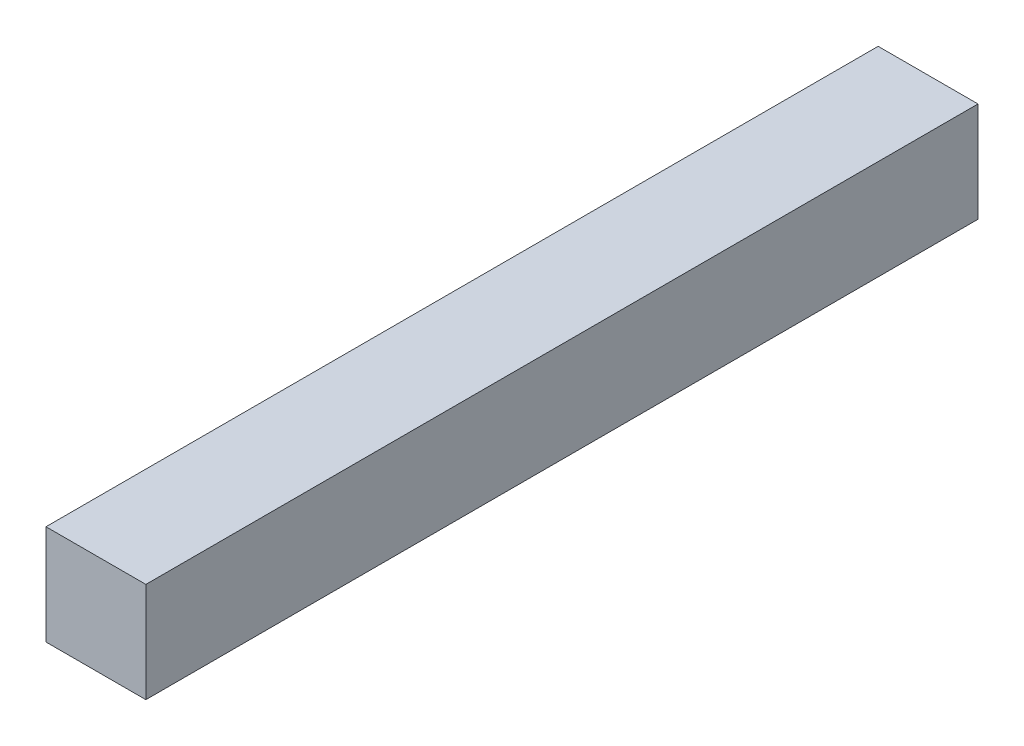
ISO-10303-21;
HEADER;
FILE_DESCRIPTION(('STEP AP214'),'2;1');
FILE_NAME('part.step','',(''),(''),'','','');
FILE_SCHEMA(('AUTOMOTIVE_DESIGN { 1 0 10303 214 1 1 1 1 }'));
ENDSEC;
DATA;
#1=APPLICATION_CONTEXT('core data for automotive mechanical design processes');
#2=APPLICATION_PROTOCOL_DEFINITION('international standard','automotive_design',2000,#1);
#3=PRODUCT_CONTEXT('',#1,'mechanical');
#4=PRODUCT('Part','Part','',(#3));
#5=PRODUCT_RELATED_PRODUCT_CATEGORY('part','',(#4));
#6=PRODUCT_DEFINITION_FORMATION('','',#4);
#7=PRODUCT_DEFINITION_CONTEXT('part definition',#1,'design');
#8=PRODUCT_DEFINITION('design','',#6,#7);
#9=PRODUCT_DEFINITION_SHAPE('','',#8);
#10=(LENGTH_UNIT() NAMED_UNIT(*) SI_UNIT(.MILLI.,.METRE.));
#11=(NAMED_UNIT(*) PLANE_ANGLE_UNIT() SI_UNIT($,.RADIAN.));
#12=(NAMED_UNIT(*) SI_UNIT($,.STERADIAN.) SOLID_ANGLE_UNIT());
#13=UNCERTAINTY_MEASURE_WITH_UNIT(LENGTH_MEASURE(1.E-05),#10,'distance_accuracy_value','');
#14=(GEOMETRIC_REPRESENTATION_CONTEXT(3) GLOBAL_UNCERTAINTY_ASSIGNED_CONTEXT((#13)) GLOBAL_UNIT_ASSIGNED_CONTEXT((#10,
#11,#12)) REPRESENTATION_CONTEXT('',''));
#15=CARTESIAN_POINT('',(0.,0.,0.));
#16=DIRECTION('',(0.,0.,1.));
#17=DIRECTION('',(1.,0.,0.));
#18=AXIS2_PLACEMENT_3D('',#15,#16,#17);
#19=CARTESIAN_POINT('',(0.,0.,25.));
#20=DIRECTION('',(1.,0.,0.));
#21=DIRECTION('',(0.,1.,0.));
#22=AXIS2_PLACEMENT_3D('',#19,#20,#21);
#23=PLANE('',#22);
#24=DIRECTION('',(0.,-1.,0.));
#25=VECTOR('',#24,1.);
#26=CARTESIAN_POINT('',(0.,0.,0.));
#27=LINE('',#26,#25);
#28=CARTESIAN_POINT('',(0.,0.,0.));
#29=VERTEX_POINT('',#28);
#30=CARTESIAN_POINT('',(0.,-3.,0.));
#31=VERTEX_POINT('',#30);
#32=EDGE_CURVE('E109',#29,#31,#27,.T.);
#33=ORIENTED_EDGE('',*,*,#32,.T.);
#34=DIRECTION('',(0.,0.,-1.));
#35=VECTOR('',#34,1.);
#36=CARTESIAN_POINT('',(0.,-3.,25.));
#37=LINE('',#36,#35);
#38=CARTESIAN_POINT('',(0.,-3.,25.));
#39=VERTEX_POINT('',#38);
#40=EDGE_CURVE('E11',#39,#31,#37,.T.);
#41=ORIENTED_EDGE('',*,*,#40,.F.);
#42=DIRECTION('',(0.,-1.,0.));
#43=VECTOR('',#42,1.);
#44=CARTESIAN_POINT('',(0.,0.,25.));
#45=LINE('',#44,#43);
#46=CARTESIAN_POINT('',(0.,0.,25.));
#47=VERTEX_POINT('',#46);
#48=EDGE_CURVE('E93',#47,#39,#45,.T.);
#49=ORIENTED_EDGE('',*,*,#48,.F.);
#50=DIRECTION('',(0.,0.,-1.));
#51=VECTOR('',#50,1.);
#52=CARTESIAN_POINT('',(0.,0.,25.));
#53=LINE('',#52,#51);
#54=EDGE_CURVE('E105',#47,#29,#53,.T.);
#55=ORIENTED_EDGE('',*,*,#54,.T.);
#56=EDGE_LOOP('',(#33,#41,#49,#55));
#57=FACE_BOUND('',#56,.T.);
#58=ADVANCED_FACE('F41',(#57),#23,.F.);
#59=CARTESIAN_POINT('',(0.,-3.,25.));
#60=DIRECTION('',(0.,1.,0.));
#61=DIRECTION('',(0.,0.,1.));
#62=AXIS2_PLACEMENT_3D('',#59,#60,#61);
#63=PLANE('',#62);
#64=DIRECTION('',(1.,0.,0.));
#65=VECTOR('',#64,1.);
#66=CARTESIAN_POINT('',(0.,-3.,0.));
#67=LINE('',#66,#65);
#68=CARTESIAN_POINT('',(3.,-3.,0.));
#69=VERTEX_POINT('',#68);
#70=EDGE_CURVE('E98',#31,#69,#67,.T.);
#71=ORIENTED_EDGE('',*,*,#70,.T.);
#72=DIRECTION('',(0.,0.,-1.));
#73=VECTOR('',#72,1.);
#74=CARTESIAN_POINT('',(3.,-3.,25.));
#75=LINE('',#74,#73);
#76=CARTESIAN_POINT('',(3.,-3.,25.));
#77=VERTEX_POINT('',#76);
#78=EDGE_CURVE('E50',#77,#69,#75,.T.);
#79=ORIENTED_EDGE('',*,*,#78,.F.);
#80=DIRECTION('',(1.,0.,0.));
#81=VECTOR('',#80,1.);
#82=CARTESIAN_POINT('',(0.,-3.,25.));
#83=LINE('',#82,#81);
#84=EDGE_CURVE('E88',#39,#77,#83,.T.);
#85=ORIENTED_EDGE('',*,*,#84,.F.);
#86=ORIENTED_EDGE('',*,*,#40,.T.);
#87=EDGE_LOOP('',(#71,#79,#85,#86));
#88=FACE_BOUND('',#87,.T.);
#89=ADVANCED_FACE('F97',(#88),#63,.F.);
#90=CARTESIAN_POINT('',(3.,0.,25.));
#91=DIRECTION('',(-1.,0.,0.));
#92=DIRECTION('',(0.,-1.,0.));
#93=AXIS2_PLACEMENT_3D('',#90,#91,#92);
#94=PLANE('',#93);
#95=DIRECTION('',(0.,1.,0.));
#96=VECTOR('',#95,1.);
#97=CARTESIAN_POINT('',(3.,0.,0.));
#98=LINE('',#97,#96);
#99=CARTESIAN_POINT('',(3.,0.,0.));
#100=VERTEX_POINT('',#99);
#101=EDGE_CURVE('E75',#69,#100,#98,.T.);
#102=ORIENTED_EDGE('',*,*,#101,.T.);
#103=DIRECTION('',(0.,0.,-1.));
#104=VECTOR('',#103,1.);
#105=CARTESIAN_POINT('',(3.,0.,25.));
#106=LINE('',#105,#104);
#107=CARTESIAN_POINT('',(3.,0.,25.));
#108=VERTEX_POINT('',#107);
#109=EDGE_CURVE('E100',#108,#100,#106,.T.);
#110=ORIENTED_EDGE('',*,*,#109,.F.);
#111=DIRECTION('',(0.,1.,0.));
#112=VECTOR('',#111,1.);
#113=CARTESIAN_POINT('',(3.,0.,25.));
#114=LINE('',#113,#112);
#115=EDGE_CURVE('E91',#77,#108,#114,.T.);
#116=ORIENTED_EDGE('',*,*,#115,.F.);
#117=ORIENTED_EDGE('',*,*,#78,.T.);
#118=EDGE_LOOP('',(#102,#110,#116,#117));
#119=FACE_BOUND('',#118,.T.);
#120=ADVANCED_FACE('F101',(#119),#94,.F.);
#121=CARTESIAN_POINT('',(0.,0.,25.));
#122=DIRECTION('',(0.,-1.,0.));
#123=DIRECTION('',(0.,0.,-1.));
#124=AXIS2_PLACEMENT_3D('',#121,#122,#123);
#125=PLANE('',#124);
#126=DIRECTION('',(-1.,0.,0.));
#127=VECTOR('',#126,1.);
#128=CARTESIAN_POINT('',(0.,0.,0.));
#129=LINE('',#128,#127);
#130=EDGE_CURVE('E81',#100,#29,#129,.T.);
#131=ORIENTED_EDGE('',*,*,#130,.T.);
#132=ORIENTED_EDGE('',*,*,#54,.F.);
#133=DIRECTION('',(-1.,0.,0.));
#134=VECTOR('',#133,1.);
#135=CARTESIAN_POINT('',(0.,0.,25.));
#136=LINE('',#135,#134);
#137=EDGE_CURVE('E58',#108,#47,#136,.T.);
#138=ORIENTED_EDGE('',*,*,#137,.F.);
#139=ORIENTED_EDGE('',*,*,#109,.T.);
#140=EDGE_LOOP('',(#131,#132,#138,#139));
#141=FACE_BOUND('',#140,.T.);
#142=ADVANCED_FACE('F122',(#141),#125,.F.);
#143=CARTESIAN_POINT('',(0.,0.,25.));
#144=DIRECTION('',(0.,0.,1.));
#145=DIRECTION('',(1.,0.,0.));
#146=AXIS2_PLACEMENT_3D('',#143,#144,#145);
#147=PLANE('',#146);
#148=ORIENTED_EDGE('',*,*,#48,.T.);
#149=ORIENTED_EDGE('',*,*,#84,.T.);
#150=ORIENTED_EDGE('',*,*,#115,.T.);
#151=ORIENTED_EDGE('',*,*,#137,.T.);
#152=EDGE_LOOP('',(#148,#149,#150,#151));
#153=FACE_BOUND('',#152,.T.);
#154=ADVANCED_FACE('F89',(#153),#147,.T.);
#155=CARTESIAN_POINT('',(0.,0.,0.));
#156=DIRECTION('',(0.,0.,1.));
#157=DIRECTION('',(1.,0.,0.));
#158=AXIS2_PLACEMENT_3D('',#155,#156,#157);
#159=PLANE('',#158);
#160=ORIENTED_EDGE('',*,*,#32,.F.);
#161=ORIENTED_EDGE('',*,*,#130,.F.);
#162=ORIENTED_EDGE('',*,*,#101,.F.);
#163=ORIENTED_EDGE('',*,*,#70,.F.);
#164=EDGE_LOOP('',(#160,#161,#162,#163));
#165=FACE_BOUND('',#164,.T.);
#166=ADVANCED_FACE('F125',(#165),#159,.F.);
#167=CLOSED_SHELL('',(#58,#89,#120,#142,#154,#166));
#168=MANIFOLD_SOLID_BREP('B2',#167);
#169=ADVANCED_BREP_SHAPE_REPRESENTATION('',(#18,#168),#14);
#170=SHAPE_DEFINITION_REPRESENTATION(#9,#169);
ENDSEC;
END-ISO-10303-21;
